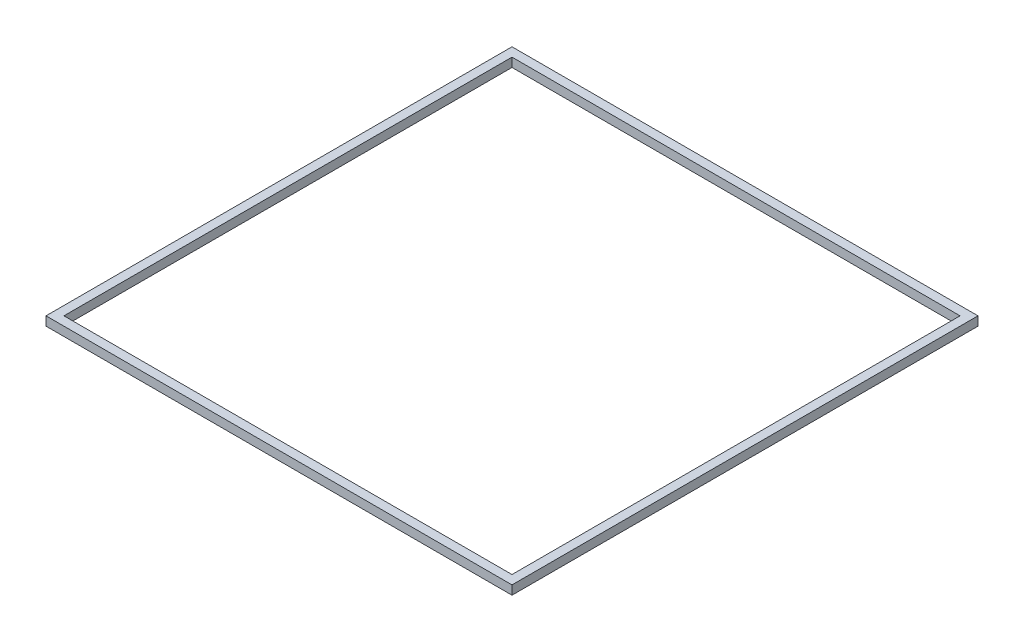
ISO-10303-21;
HEADER;
FILE_DESCRIPTION(('STEP AP214'),'2;1');
FILE_NAME('part.step','',(''),(''),'','','');
FILE_SCHEMA(('AUTOMOTIVE_DESIGN { 1 0 10303 214 1 1 1 1 }'));
ENDSEC;
DATA;
#1=APPLICATION_CONTEXT('core data for automotive mechanical design processes');
#2=APPLICATION_PROTOCOL_DEFINITION('international standard','automotive_design',2000,#1);
#3=PRODUCT_CONTEXT('',#1,'mechanical');
#4=PRODUCT('Part','Part','',(#3));
#5=PRODUCT_RELATED_PRODUCT_CATEGORY('part','',(#4));
#6=PRODUCT_DEFINITION_FORMATION('','',#4);
#7=PRODUCT_DEFINITION_CONTEXT('part definition',#1,'design');
#8=PRODUCT_DEFINITION('design','',#6,#7);
#9=PRODUCT_DEFINITION_SHAPE('','',#8);
#10=(LENGTH_UNIT() NAMED_UNIT(*) SI_UNIT(.MILLI.,.METRE.));
#11=(NAMED_UNIT(*) PLANE_ANGLE_UNIT() SI_UNIT($,.RADIAN.));
#12=(NAMED_UNIT(*) SI_UNIT($,.STERADIAN.) SOLID_ANGLE_UNIT());
#13=UNCERTAINTY_MEASURE_WITH_UNIT(LENGTH_MEASURE(1.E-05),#10,'distance_accuracy_value','');
#14=(GEOMETRIC_REPRESENTATION_CONTEXT(3) GLOBAL_UNCERTAINTY_ASSIGNED_CONTEXT((#13)) GLOBAL_UNIT_ASSIGNED_CONTEXT((#10,
#11,#12)) REPRESENTATION_CONTEXT('',''));
#15=CARTESIAN_POINT('',(0.,0.,0.));
#16=DIRECTION('',(0.,0.,1.));
#17=DIRECTION('',(1.,0.,0.));
#18=AXIS2_PLACEMENT_3D('',#15,#16,#17);
#19=CARTESIAN_POINT('',(0.,2.,0.));
#20=DIRECTION('',(0.,1.,0.));
#21=DIRECTION('',(0.,0.,1.));
#22=AXIS2_PLACEMENT_3D('',#19,#20,#21);
#23=PLANE('',#22);
#24=DIRECTION('',(0.,0.,1.));
#25=VECTOR('',#24,1.);
#26=CARTESIAN_POINT('',(-52.,2.,-52.));
#27=LINE('',#26,#25);
#28=CARTESIAN_POINT('',(-52.,2.,-52.));
#29=VERTEX_POINT('',#28);
#30=CARTESIAN_POINT('',(-52.,2.,52.));
#31=VERTEX_POINT('',#30);
#32=EDGE_CURVE('E134',#29,#31,#27,.T.);
#33=ORIENTED_EDGE('',*,*,#32,.T.);
#34=DIRECTION('',(1.,0.,0.));
#35=VECTOR('',#34,1.);
#36=CARTESIAN_POINT('',(-52.,2.,52.));
#37=LINE('',#36,#35);
#38=CARTESIAN_POINT('',(52.,2.,52.));
#39=VERTEX_POINT('',#38);
#40=EDGE_CURVE('E137',#31,#39,#37,.T.);
#41=ORIENTED_EDGE('',*,*,#40,.T.);
#42=DIRECTION('',(0.,0.,-1.));
#43=VECTOR('',#42,1.);
#44=CARTESIAN_POINT('',(52.,2.,-52.));
#45=LINE('',#44,#43);
#46=CARTESIAN_POINT('',(52.,2.,-52.));
#47=VERTEX_POINT('',#46);
#48=EDGE_CURVE('E140',#39,#47,#45,.T.);
#49=ORIENTED_EDGE('',*,*,#48,.T.);
#50=DIRECTION('',(-1.,0.,0.));
#51=VECTOR('',#50,1.);
#52=CARTESIAN_POINT('',(-52.,2.,-52.));
#53=LINE('',#52,#51);
#54=EDGE_CURVE('E142',#47,#29,#53,.T.);
#55=ORIENTED_EDGE('',*,*,#54,.T.);
#56=EDGE_LOOP('',(#33,#41,#49,#55));
#57=FACE_BOUND('',#56,.T.);
#58=DIRECTION('',(-1.,0.,0.));
#59=VECTOR('',#58,1.);
#60=CARTESIAN_POINT('',(-50.,2.,-50.));
#61=LINE('',#60,#59);
#62=CARTESIAN_POINT('',(50.,2.,-50.));
#63=VERTEX_POINT('',#62);
#64=CARTESIAN_POINT('',(-50.,2.,-50.));
#65=VERTEX_POINT('',#64);
#66=EDGE_CURVE('E106',#63,#65,#61,.T.);
#67=ORIENTED_EDGE('',*,*,#66,.F.);
#68=DIRECTION('',(0.,0.,-1.));
#69=VECTOR('',#68,1.);
#70=CARTESIAN_POINT('',(50.,2.,-50.));
#71=LINE('',#70,#69);
#72=CARTESIAN_POINT('',(50.,2.,50.));
#73=VERTEX_POINT('',#72);
#74=EDGE_CURVE('E98',#73,#63,#71,.T.);
#75=ORIENTED_EDGE('',*,*,#74,.F.);
#76=DIRECTION('',(1.,0.,0.));
#77=VECTOR('',#76,1.);
#78=CARTESIAN_POINT('',(-50.,2.,50.));
#79=LINE('',#78,#77);
#80=CARTESIAN_POINT('',(-50.,2.,50.));
#81=VERTEX_POINT('',#80);
#82=EDGE_CURVE('E120',#81,#73,#79,.T.);
#83=ORIENTED_EDGE('',*,*,#82,.F.);
#84=DIRECTION('',(0.,0.,1.));
#85=VECTOR('',#84,1.);
#86=CARTESIAN_POINT('',(-50.,2.,-50.));
#87=LINE('',#86,#85);
#88=EDGE_CURVE('E118',#65,#81,#87,.T.);
#89=ORIENTED_EDGE('',*,*,#88,.F.);
#90=EDGE_LOOP('',(#67,#75,#83,#89));
#91=FACE_BOUND('',#90,.T.);
#92=ADVANCED_FACE('F33',(#57,#91),#23,.T.);
#93=CARTESIAN_POINT('',(0.,0.,0.));
#94=DIRECTION('',(0.,1.,0.));
#95=DIRECTION('',(0.,0.,1.));
#96=AXIS2_PLACEMENT_3D('',#93,#94,#95);
#97=PLANE('',#96);
#98=DIRECTION('',(0.,0.,1.));
#99=VECTOR('',#98,1.);
#100=CARTESIAN_POINT('',(-52.,0.,-52.));
#101=LINE('',#100,#99);
#102=CARTESIAN_POINT('',(-52.,0.,-52.));
#103=VERTEX_POINT('',#102);
#104=CARTESIAN_POINT('',(-52.,0.,52.));
#105=VERTEX_POINT('',#104);
#106=EDGE_CURVE('E114',#103,#105,#101,.T.);
#107=ORIENTED_EDGE('',*,*,#106,.F.);
#108=DIRECTION('',(-1.,0.,0.));
#109=VECTOR('',#108,1.);
#110=CARTESIAN_POINT('',(-52.,0.,-52.));
#111=LINE('',#110,#109);
#112=CARTESIAN_POINT('',(52.,0.,-52.));
#113=VERTEX_POINT('',#112);
#114=EDGE_CURVE('E138',#113,#103,#111,.T.);
#115=ORIENTED_EDGE('',*,*,#114,.F.);
#116=DIRECTION('',(0.,0.,-1.));
#117=VECTOR('',#116,1.);
#118=CARTESIAN_POINT('',(52.,0.,-52.));
#119=LINE('',#118,#117);
#120=CARTESIAN_POINT('',(52.,0.,52.));
#121=VERTEX_POINT('',#120);
#122=EDGE_CURVE('E149',#121,#113,#119,.T.);
#123=ORIENTED_EDGE('',*,*,#122,.F.);
#124=DIRECTION('',(1.,0.,0.));
#125=VECTOR('',#124,1.);
#126=CARTESIAN_POINT('',(-52.,0.,52.));
#127=LINE('',#126,#125);
#128=EDGE_CURVE('E147',#105,#121,#127,.T.);
#129=ORIENTED_EDGE('',*,*,#128,.F.);
#130=EDGE_LOOP('',(#107,#115,#123,#129));
#131=FACE_BOUND('',#130,.T.);
#132=DIRECTION('',(0.,0.,-1.));
#133=VECTOR('',#132,1.);
#134=CARTESIAN_POINT('',(50.,0.,-50.));
#135=LINE('',#134,#133);
#136=CARTESIAN_POINT('',(50.,0.,50.));
#137=VERTEX_POINT('',#136);
#138=CARTESIAN_POINT('',(50.,0.,-50.));
#139=VERTEX_POINT('',#138);
#140=EDGE_CURVE('E56',#137,#139,#135,.T.);
#141=ORIENTED_EDGE('',*,*,#140,.T.);
#142=DIRECTION('',(-1.,0.,0.));
#143=VECTOR('',#142,1.);
#144=CARTESIAN_POINT('',(-50.,0.,-50.));
#145=LINE('',#144,#143);
#146=CARTESIAN_POINT('',(-50.,0.,-50.));
#147=VERTEX_POINT('',#146);
#148=EDGE_CURVE('E113',#139,#147,#145,.T.);
#149=ORIENTED_EDGE('',*,*,#148,.T.);
#150=DIRECTION('',(0.,0.,1.));
#151=VECTOR('',#150,1.);
#152=CARTESIAN_POINT('',(-50.,0.,-50.));
#153=LINE('',#152,#151);
#154=CARTESIAN_POINT('',(-50.,0.,50.));
#155=VERTEX_POINT('',#154);
#156=EDGE_CURVE('E126',#147,#155,#153,.T.);
#157=ORIENTED_EDGE('',*,*,#156,.T.);
#158=DIRECTION('',(1.,0.,0.));
#159=VECTOR('',#158,1.);
#160=CARTESIAN_POINT('',(-50.,0.,50.));
#161=LINE('',#160,#159);
#162=EDGE_CURVE('E107',#155,#137,#161,.T.);
#163=ORIENTED_EDGE('',*,*,#162,.T.);
#164=EDGE_LOOP('',(#141,#149,#157,#163));
#165=FACE_BOUND('',#164,.T.);
#166=ADVANCED_FACE('F167',(#131,#165),#97,.F.);
#167=CARTESIAN_POINT('',(-52.,2.,-52.));
#168=DIRECTION('',(1.,0.,0.));
#169=DIRECTION('',(0.,0.,-1.));
#170=AXIS2_PLACEMENT_3D('',#167,#168,#169);
#171=PLANE('',#170);
#172=ORIENTED_EDGE('',*,*,#106,.T.);
#173=DIRECTION('',(0.,-1.,0.));
#174=VECTOR('',#173,1.);
#175=CARTESIAN_POINT('',(-52.,2.,52.));
#176=LINE('',#175,#174);
#177=EDGE_CURVE('E11',#31,#105,#176,.T.);
#178=ORIENTED_EDGE('',*,*,#177,.F.);
#179=ORIENTED_EDGE('',*,*,#32,.F.);
#180=DIRECTION('',(0.,-1.,0.));
#181=VECTOR('',#180,1.);
#182=CARTESIAN_POINT('',(-52.,2.,-52.));
#183=LINE('',#182,#181);
#184=EDGE_CURVE('E144',#29,#103,#183,.T.);
#185=ORIENTED_EDGE('',*,*,#184,.T.);
#186=EDGE_LOOP('',(#172,#178,#179,#185));
#187=FACE_BOUND('',#186,.T.);
#188=ADVANCED_FACE('F35',(#187),#171,.F.);
#189=CARTESIAN_POINT('',(-52.,2.,52.));
#190=DIRECTION('',(0.,0.,-1.));
#191=DIRECTION('',(-1.,0.,0.));
#192=AXIS2_PLACEMENT_3D('',#189,#190,#191);
#193=PLANE('',#192);
#194=ORIENTED_EDGE('',*,*,#128,.T.);
#195=DIRECTION('',(0.,-1.,0.));
#196=VECTOR('',#195,1.);
#197=CARTESIAN_POINT('',(52.,2.,52.));
#198=LINE('',#197,#196);
#199=EDGE_CURVE('E41',#39,#121,#198,.T.);
#200=ORIENTED_EDGE('',*,*,#199,.F.);
#201=ORIENTED_EDGE('',*,*,#40,.F.);
#202=ORIENTED_EDGE('',*,*,#177,.T.);
#203=EDGE_LOOP('',(#194,#200,#201,#202));
#204=FACE_BOUND('',#203,.T.);
#205=ADVANCED_FACE('F177',(#204),#193,.F.);
#206=CARTESIAN_POINT('',(52.,2.,-52.));
#207=DIRECTION('',(-1.,0.,0.));
#208=DIRECTION('',(0.,0.,1.));
#209=AXIS2_PLACEMENT_3D('',#206,#207,#208);
#210=PLANE('',#209);
#211=ORIENTED_EDGE('',*,*,#122,.T.);
#212=DIRECTION('',(0.,-1.,0.));
#213=VECTOR('',#212,1.);
#214=CARTESIAN_POINT('',(52.,2.,-52.));
#215=LINE('',#214,#213);
#216=EDGE_CURVE('E154',#47,#113,#215,.T.);
#217=ORIENTED_EDGE('',*,*,#216,.F.);
#218=ORIENTED_EDGE('',*,*,#48,.F.);
#219=ORIENTED_EDGE('',*,*,#199,.T.);
#220=EDGE_LOOP('',(#211,#217,#218,#219));
#221=FACE_BOUND('',#220,.T.);
#222=ADVANCED_FACE('F161',(#221),#210,.F.);
#223=CARTESIAN_POINT('',(-52.,2.,-52.));
#224=DIRECTION('',(0.,0.,1.));
#225=DIRECTION('',(1.,0.,0.));
#226=AXIS2_PLACEMENT_3D('',#223,#224,#225);
#227=PLANE('',#226);
#228=ORIENTED_EDGE('',*,*,#114,.T.);
#229=ORIENTED_EDGE('',*,*,#184,.F.);
#230=ORIENTED_EDGE('',*,*,#54,.F.);
#231=ORIENTED_EDGE('',*,*,#216,.T.);
#232=EDGE_LOOP('',(#228,#229,#230,#231));
#233=FACE_BOUND('',#232,.T.);
#234=ADVANCED_FACE('F171',(#233),#227,.F.);
#235=CARTESIAN_POINT('',(50.,2.,-50.));
#236=DIRECTION('',(-1.,0.,0.));
#237=DIRECTION('',(0.,0.,1.));
#238=AXIS2_PLACEMENT_3D('',#235,#236,#237);
#239=PLANE('',#238);
#240=ORIENTED_EDGE('',*,*,#140,.F.);
#241=DIRECTION('',(0.,-1.,0.));
#242=VECTOR('',#241,1.);
#243=CARTESIAN_POINT('',(50.,2.,50.));
#244=LINE('',#243,#242);
#245=EDGE_CURVE('E102',#73,#137,#244,.T.);
#246=ORIENTED_EDGE('',*,*,#245,.F.);
#247=ORIENTED_EDGE('',*,*,#74,.T.);
#248=DIRECTION('',(0.,-1.,0.));
#249=VECTOR('',#248,1.);
#250=CARTESIAN_POINT('',(50.,2.,-50.));
#251=LINE('',#250,#249);
#252=EDGE_CURVE('E101',#63,#139,#251,.T.);
#253=ORIENTED_EDGE('',*,*,#252,.T.);
#254=EDGE_LOOP('',(#240,#246,#247,#253));
#255=FACE_BOUND('',#254,.T.);
#256=ADVANCED_FACE('F100',(#255),#239,.T.);
#257=CARTESIAN_POINT('',(-50.,2.,-50.));
#258=DIRECTION('',(0.,0.,1.));
#259=DIRECTION('',(1.,0.,0.));
#260=AXIS2_PLACEMENT_3D('',#257,#258,#259);
#261=PLANE('',#260);
#262=ORIENTED_EDGE('',*,*,#148,.F.);
#263=ORIENTED_EDGE('',*,*,#252,.F.);
#264=ORIENTED_EDGE('',*,*,#66,.T.);
#265=DIRECTION('',(0.,-1.,0.));
#266=VECTOR('',#265,1.);
#267=CARTESIAN_POINT('',(-50.,2.,-50.));
#268=LINE('',#267,#266);
#269=EDGE_CURVE('E115',#65,#147,#268,.T.);
#270=ORIENTED_EDGE('',*,*,#269,.T.);
#271=EDGE_LOOP('',(#262,#263,#264,#270));
#272=FACE_BOUND('',#271,.T.);
#273=ADVANCED_FACE('F110',(#272),#261,.T.);
#274=CARTESIAN_POINT('',(-50.,2.,-50.));
#275=DIRECTION('',(1.,0.,0.));
#276=DIRECTION('',(0.,0.,-1.));
#277=AXIS2_PLACEMENT_3D('',#274,#275,#276);
#278=PLANE('',#277);
#279=ORIENTED_EDGE('',*,*,#156,.F.);
#280=ORIENTED_EDGE('',*,*,#269,.F.);
#281=ORIENTED_EDGE('',*,*,#88,.T.);
#282=DIRECTION('',(0.,-1.,0.));
#283=VECTOR('',#282,1.);
#284=CARTESIAN_POINT('',(-50.,2.,50.));
#285=LINE('',#284,#283);
#286=EDGE_CURVE('E48',#81,#155,#285,.T.);
#287=ORIENTED_EDGE('',*,*,#286,.T.);
#288=EDGE_LOOP('',(#279,#280,#281,#287));
#289=FACE_BOUND('',#288,.T.);
#290=ADVANCED_FACE('F200',(#289),#278,.T.);
#291=CARTESIAN_POINT('',(-50.,2.,50.));
#292=DIRECTION('',(0.,0.,-1.));
#293=DIRECTION('',(-1.,0.,0.));
#294=AXIS2_PLACEMENT_3D('',#291,#292,#293);
#295=PLANE('',#294);
#296=ORIENTED_EDGE('',*,*,#162,.F.);
#297=ORIENTED_EDGE('',*,*,#286,.F.);
#298=ORIENTED_EDGE('',*,*,#82,.T.);
#299=ORIENTED_EDGE('',*,*,#245,.T.);
#300=EDGE_LOOP('',(#296,#297,#298,#299));
#301=FACE_BOUND('',#300,.T.);
#302=ADVANCED_FACE('F204',(#301),#295,.T.);
#303=CLOSED_SHELL('',(#92,#166,#188,#205,#222,#234,#256,#273,#290,#302));
#304=MANIFOLD_SOLID_BREP('B2',#303);
#305=ADVANCED_BREP_SHAPE_REPRESENTATION('',(#18,#304),#14);
#306=SHAPE_DEFINITION_REPRESENTATION(#9,#305);
ENDSEC;
END-ISO-10303-21;
